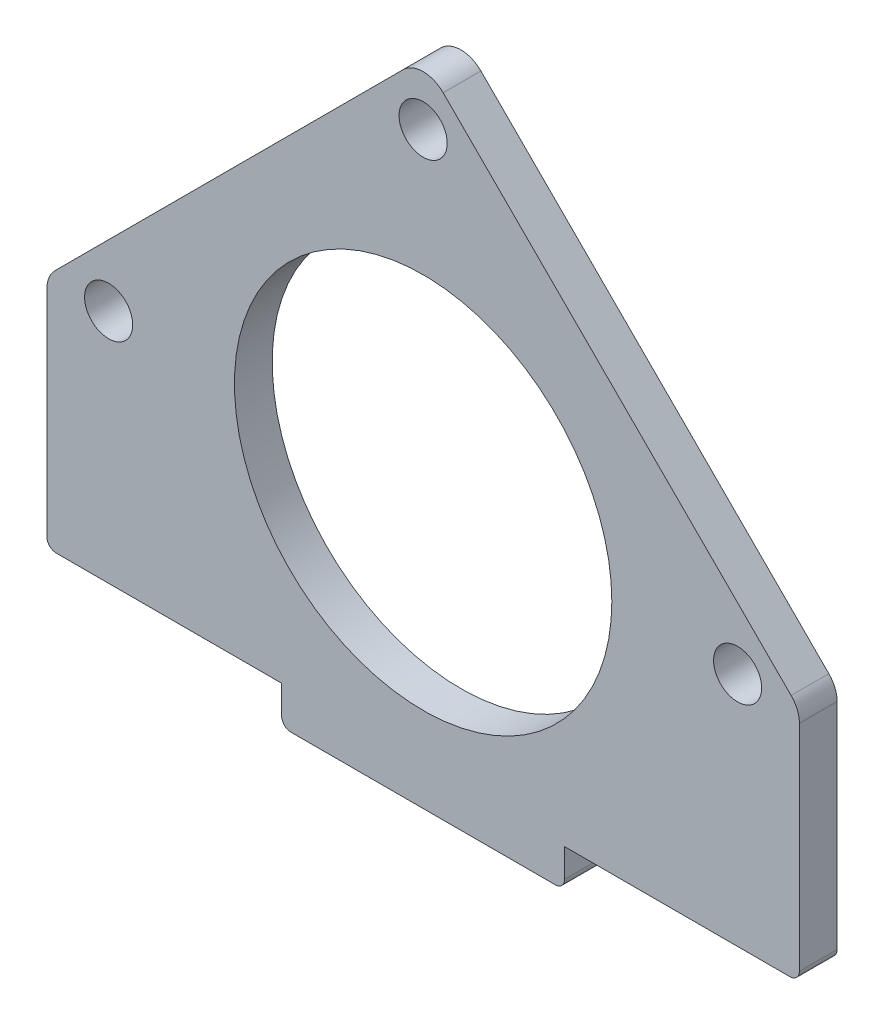
ISO-10303-21;
HEADER;
FILE_DESCRIPTION(('STEP AP214'),'2;1');
FILE_NAME('part.step','',(''),(''),'','','');
FILE_SCHEMA(('AUTOMOTIVE_DESIGN { 1 0 10303 214 1 1 1 1 }'));
ENDSEC;
DATA;
#1=APPLICATION_CONTEXT('core data for automotive mechanical design processes');
#2=APPLICATION_PROTOCOL_DEFINITION('international standard','automotive_design',2000,#1);
#3=PRODUCT_CONTEXT('',#1,'mechanical');
#4=PRODUCT('Part','Part','',(#3));
#5=PRODUCT_RELATED_PRODUCT_CATEGORY('part','',(#4));
#6=PRODUCT_DEFINITION_FORMATION('','',#4);
#7=PRODUCT_DEFINITION_CONTEXT('part definition',#1,'design');
#8=PRODUCT_DEFINITION('design','',#6,#7);
#9=PRODUCT_DEFINITION_SHAPE('','',#8);
#10=(LENGTH_UNIT() NAMED_UNIT(*) SI_UNIT(.MILLI.,.METRE.));
#11=(NAMED_UNIT(*) PLANE_ANGLE_UNIT() SI_UNIT($,.RADIAN.));
#12=(NAMED_UNIT(*) SI_UNIT($,.STERADIAN.) SOLID_ANGLE_UNIT());
#13=UNCERTAINTY_MEASURE_WITH_UNIT(LENGTH_MEASURE(1.E-05),#10,'distance_accuracy_value','');
#14=(GEOMETRIC_REPRESENTATION_CONTEXT(3) GLOBAL_UNCERTAINTY_ASSIGNED_CONTEXT((#13)) GLOBAL_UNIT_ASSIGNED_CONTEXT((#10,
#11,#12)) REPRESENTATION_CONTEXT('',''));
#15=CARTESIAN_POINT('',(0.,0.,0.));
#16=DIRECTION('',(0.,0.,1.));
#17=DIRECTION('',(1.,0.,0.));
#18=AXIS2_PLACEMENT_3D('',#15,#16,#17);
#19=CARTESIAN_POINT('',(0.,0.,4.));
#20=DIRECTION('',(0.,0.,1.));
#21=DIRECTION('',(1.,0.,0.));
#22=AXIS2_PLACEMENT_3D('',#19,#20,#21);
#23=PLANE('',#22);
#24=CARTESIAN_POINT('',(33.3330136651338,0.,4.));
#25=DIRECTION('',(0.,0.,1.));
#26=DIRECTION('',(1.,0.,0.));
#27=AXIS2_PLACEMENT_3D('',#24,#25,#26);
#28=CIRCLE('',#27,2.55);
#29=CARTESIAN_POINT('',(35.8830136651338,0.,4.));
#30=VERTEX_POINT('',#29);
#31=EDGE_CURVE('E340',#30,#30,#28,.T.);
#32=ORIENTED_EDGE('',*,*,#31,.F.);
#33=EDGE_LOOP('',(#32));
#34=FACE_BOUND('',#33,.T.);
#35=CARTESIAN_POINT('',(-33.3330136651338,0.,4.));
#36=DIRECTION('',(0.,0.,1.));
#37=DIRECTION('',(1.,0.,0.));
#38=AXIS2_PLACEMENT_3D('',#35,#36,#37);
#39=CIRCLE('',#38,2.55);
#40=CARTESIAN_POINT('',(-30.7830136651338,0.,4.));
#41=VERTEX_POINT('',#40);
#42=EDGE_CURVE('E195',#41,#41,#39,.T.);
#43=ORIENTED_EDGE('',*,*,#42,.F.);
#44=EDGE_LOOP('',(#43));
#45=FACE_BOUND('',#44,.T.);
#46=DIRECTION('',(1.,0.,0.));
#47=VECTOR('',#46,1.);
#48=CARTESIAN_POINT('',(15.,-29.,4.));
#49=LINE('',#48,#47);
#50=CARTESIAN_POINT('',(-14.,-29.,4.));
#51=VERTEX_POINT('',#50);
#52=CARTESIAN_POINT('',(14.,-29.,4.));
#53=VERTEX_POINT('',#52);
#54=EDGE_CURVE('E175',#51,#53,#49,.T.);
#55=ORIENTED_EDGE('',*,*,#54,.T.);
#56=CARTESIAN_POINT('',(14.,-28.,4.));
#57=DIRECTION('',(0.,0.,1.));
#58=DIRECTION('',(1.,0.,0.));
#59=AXIS2_PLACEMENT_3D('',#56,#57,#58);
#60=CIRCLE('',#59,1.);
#61=CARTESIAN_POINT('',(15.,-28.,4.));
#62=VERTEX_POINT('',#61);
#63=EDGE_CURVE('E265',#53,#62,#60,.T.);
#64=ORIENTED_EDGE('',*,*,#63,.T.);
#65=DIRECTION('',(0.,1.,0.));
#66=VECTOR('',#65,1.);
#67=CARTESIAN_POINT('',(15.,-29.,4.));
#68=LINE('',#67,#66);
#69=CARTESIAN_POINT('',(15.,-25.,4.));
#70=VERTEX_POINT('',#69);
#71=EDGE_CURVE('E177',#62,#70,#68,.T.);
#72=ORIENTED_EDGE('',*,*,#71,.T.);
#73=DIRECTION('',(1.,0.,0.));
#74=VECTOR('',#73,1.);
#75=CARTESIAN_POINT('',(15.,-25.,4.));
#76=LINE('',#75,#74);
#77=CARTESIAN_POINT('',(38.8808224589212,-25.,4.));
#78=VERTEX_POINT('',#77);
#79=EDGE_CURVE('E182',#70,#78,#76,.T.);
#80=ORIENTED_EDGE('',*,*,#79,.T.);
#81=CARTESIAN_POINT('',(38.8808224589212,-24.,4.));
#82=DIRECTION('',(0.,0.,1.));
#83=DIRECTION('',(1.,0.,0.));
#84=AXIS2_PLACEMENT_3D('',#81,#82,#83);
#85=CIRCLE('',#84,1.);
#86=CARTESIAN_POINT('',(39.8808224589212,-24.,4.));
#87=VERTEX_POINT('',#86);
#88=EDGE_CURVE('E263',#78,#87,#85,.T.);
#89=ORIENTED_EDGE('',*,*,#88,.T.);
#90=DIRECTION('',(0.,1.,0.));
#91=VECTOR('',#90,1.);
#92=CARTESIAN_POINT('',(39.8808224589212,-25.,4.));
#93=LINE('',#92,#91);
#94=CARTESIAN_POINT('',(39.8808224589212,-1.24264068711931,4.));
#95=VERTEX_POINT('',#94);
#96=EDGE_CURVE('E184',#87,#95,#93,.T.);
#97=ORIENTED_EDGE('',*,*,#96,.T.);
#98=CARTESIAN_POINT('',(36.8808224589212,-1.2426406871193,4.));
#99=DIRECTION('',(0.,0.,1.));
#100=DIRECTION('',(1.,0.,0.));
#101=AXIS2_PLACEMENT_3D('',#98,#99,#100);
#102=CIRCLE('',#101,3.);
#103=CARTESIAN_POINT('',(39.0021428024809,0.878679656440326,4.));
#104=VERTEX_POINT('',#103);
#105=EDGE_CURVE('E234',#95,#104,#102,.T.);
#106=ORIENTED_EDGE('',*,*,#105,.T.);
#107=DIRECTION('',(-0.707106781186546,0.707106781186549,0.));
#108=VECTOR('',#107,1.);
#109=CARTESIAN_POINT('',(0.,39.8808224589213,4.));
#110=LINE('',#109,#108);
#111=CARTESIAN_POINT('',(2.12132034355964,37.7595021153617,4.));
#112=VERTEX_POINT('',#111);
#113=EDGE_CURVE('E186',#104,#112,#110,.T.);
#114=ORIENTED_EDGE('',*,*,#113,.T.);
#115=CARTESIAN_POINT('',(0.,35.638181771802,4.));
#116=DIRECTION('',(0.,0.,1.));
#117=DIRECTION('',(1.,0.,0.));
#118=AXIS2_PLACEMENT_3D('',#115,#116,#117);
#119=CIRCLE('',#118,3.);
#120=CARTESIAN_POINT('',(-2.12132034355965,37.7595021153617,4.));
#121=VERTEX_POINT('',#120);
#122=EDGE_CURVE('E230',#112,#121,#119,.T.);
#123=ORIENTED_EDGE('',*,*,#122,.T.);
#124=DIRECTION('',(-0.707106781186546,-0.707106781186549,0.));
#125=VECTOR('',#124,1.);
#126=CARTESIAN_POINT('',(-39.8808224589212,0.,4.));
#127=LINE('',#126,#125);
#128=CARTESIAN_POINT('',(-39.0021428024809,0.878679656440357,4.));
#129=VERTEX_POINT('',#128);
#130=EDGE_CURVE('E189',#121,#129,#127,.T.);
#131=ORIENTED_EDGE('',*,*,#130,.T.);
#132=CARTESIAN_POINT('',(-36.8808224589212,-1.24264068711928,4.));
#133=DIRECTION('',(0.,0.,1.));
#134=DIRECTION('',(1.,0.,0.));
#135=AXIS2_PLACEMENT_3D('',#132,#133,#134);
#136=CIRCLE('',#135,3.);
#137=CARTESIAN_POINT('',(-39.8808224589212,-1.24264068711928,4.));
#138=VERTEX_POINT('',#137);
#139=EDGE_CURVE('E232',#129,#138,#136,.T.);
#140=ORIENTED_EDGE('',*,*,#139,.T.);
#141=DIRECTION('',(0.,-1.,0.));
#142=VECTOR('',#141,1.);
#143=CARTESIAN_POINT('',(-39.8808224589212,0.,4.));
#144=LINE('',#143,#142);
#145=CARTESIAN_POINT('',(-39.8808224589212,-24.,4.));
#146=VERTEX_POINT('',#145);
#147=EDGE_CURVE('E163',#138,#146,#144,.T.);
#148=ORIENTED_EDGE('',*,*,#147,.T.);
#149=CARTESIAN_POINT('',(-38.8808224589212,-24.,4.));
#150=DIRECTION('',(0.,0.,1.));
#151=DIRECTION('',(1.,0.,0.));
#152=AXIS2_PLACEMENT_3D('',#149,#150,#151);
#153=CIRCLE('',#152,1.);
#154=CARTESIAN_POINT('',(-38.8808224589212,-25.,4.));
#155=VERTEX_POINT('',#154);
#156=EDGE_CURVE('E159',#146,#155,#153,.T.);
#157=ORIENTED_EDGE('',*,*,#156,.T.);
#158=DIRECTION('',(1.,0.,0.));
#159=VECTOR('',#158,1.);
#160=CARTESIAN_POINT('',(-39.8808224589212,-25.,4.));
#161=LINE('',#160,#159);
#162=CARTESIAN_POINT('',(-15.,-25.,4.));
#163=VERTEX_POINT('',#162);
#164=EDGE_CURVE('E151',#155,#163,#161,.T.);
#165=ORIENTED_EDGE('',*,*,#164,.T.);
#166=DIRECTION('',(0.,-1.,0.));
#167=VECTOR('',#166,1.);
#168=CARTESIAN_POINT('',(-15.,-25.,4.));
#169=LINE('',#168,#167);
#170=CARTESIAN_POINT('',(-15.,-28.,4.));
#171=VERTEX_POINT('',#170);
#172=EDGE_CURVE('E155',#163,#171,#169,.T.);
#173=ORIENTED_EDGE('',*,*,#172,.T.);
#174=CARTESIAN_POINT('',(-14.,-28.,4.));
#175=DIRECTION('',(0.,0.,1.));
#176=DIRECTION('',(1.,0.,0.));
#177=AXIS2_PLACEMENT_3D('',#174,#175,#176);
#178=CIRCLE('',#177,1.);
#179=EDGE_CURVE('E261',#171,#51,#178,.T.);
#180=ORIENTED_EDGE('',*,*,#179,.T.);
#181=EDGE_LOOP('',(#55,#64,#72,#80,#89,#97,#106,#114,#123,#131,#140,#148,#157,#165,#173,#180));
#182=FACE_BOUND('',#181,.T.);
#183=CARTESIAN_POINT('',(0.,33.3330136651338,4.));
#184=DIRECTION('',(0.,0.,1.));
#185=DIRECTION('',(1.,0.,0.));
#186=AXIS2_PLACEMENT_3D('',#183,#184,#185);
#187=CIRCLE('',#186,2.55);
#188=CARTESIAN_POINT('',(2.55,33.3330136651338,4.));
#189=VERTEX_POINT('',#188);
#190=EDGE_CURVE('E334',#189,#189,#187,.T.);
#191=ORIENTED_EDGE('',*,*,#190,.F.);
#192=EDGE_LOOP('',(#191));
#193=FACE_BOUND('',#192,.T.);
#194=CARTESIAN_POINT('',(0.,0.,4.));
#195=DIRECTION('',(0.,0.,1.));
#196=DIRECTION('',(1.,0.,0.));
#197=AXIS2_PLACEMENT_3D('',#194,#195,#196);
#198=CIRCLE('',#197,20.);
#199=CARTESIAN_POINT('',(20.,0.,4.));
#200=VERTEX_POINT('',#199);
#201=EDGE_CURVE('E346',#200,#200,#198,.T.);
#202=ORIENTED_EDGE('',*,*,#201,.F.);
#203=EDGE_LOOP('',(#202));
#204=FACE_BOUND('',#203,.T.);
#205=ADVANCED_FACE('F36',(#34,#45,#182,#193,#204),#23,.T.);
#206=CARTESIAN_POINT('',(0.,0.,0.));
#207=DIRECTION('',(0.,0.,1.));
#208=DIRECTION('',(1.,0.,0.));
#209=AXIS2_PLACEMENT_3D('',#206,#207,#208);
#210=PLANE('',#209);
#211=DIRECTION('',(0.,1.,0.));
#212=VECTOR('',#211,1.);
#213=CARTESIAN_POINT('',(15.,-29.,0.));
#214=LINE('',#213,#212);
#215=CARTESIAN_POINT('',(15.,-28.,0.));
#216=VERTEX_POINT('',#215);
#217=CARTESIAN_POINT('',(15.,-25.,0.));
#218=VERTEX_POINT('',#217);
#219=EDGE_CURVE('E202',#216,#218,#214,.T.);
#220=ORIENTED_EDGE('',*,*,#219,.F.);
#221=CARTESIAN_POINT('',(14.,-28.,0.));
#222=DIRECTION('',(0.,0.,1.));
#223=DIRECTION('',(1.,0.,0.));
#224=AXIS2_PLACEMENT_3D('',#221,#222,#223);
#225=CIRCLE('',#224,1.);
#226=CARTESIAN_POINT('',(14.,-29.,0.));
#227=VERTEX_POINT('',#226);
#228=EDGE_CURVE('E253',#216,#227,#225,.F.);
#229=ORIENTED_EDGE('',*,*,#228,.T.);
#230=DIRECTION('',(1.,0.,0.));
#231=VECTOR('',#230,1.);
#232=CARTESIAN_POINT('',(15.,-29.,0.));
#233=LINE('',#232,#231);
#234=CARTESIAN_POINT('',(-14.,-29.,0.));
#235=VERTEX_POINT('',#234);
#236=EDGE_CURVE('E199',#235,#227,#233,.T.);
#237=ORIENTED_EDGE('',*,*,#236,.F.);
#238=CARTESIAN_POINT('',(-14.,-28.,0.));
#239=DIRECTION('',(0.,0.,1.));
#240=DIRECTION('',(1.,0.,0.));
#241=AXIS2_PLACEMENT_3D('',#238,#239,#240);
#242=CIRCLE('',#241,1.);
#243=CARTESIAN_POINT('',(-15.,-28.,0.));
#244=VERTEX_POINT('',#243);
#245=EDGE_CURVE('E249',#235,#244,#242,.F.);
#246=ORIENTED_EDGE('',*,*,#245,.T.);
#247=DIRECTION('',(0.,-1.,0.));
#248=VECTOR('',#247,1.);
#249=CARTESIAN_POINT('',(-15.,-25.,0.));
#250=LINE('',#249,#248);
#251=CARTESIAN_POINT('',(-15.,-25.,0.));
#252=VERTEX_POINT('',#251);
#253=EDGE_CURVE('E197',#252,#244,#250,.T.);
#254=ORIENTED_EDGE('',*,*,#253,.F.);
#255=DIRECTION('',(1.,0.,0.));
#256=VECTOR('',#255,1.);
#257=CARTESIAN_POINT('',(-39.8808224589212,-25.,0.));
#258=LINE('',#257,#256);
#259=CARTESIAN_POINT('',(-38.8808224589212,-25.,0.));
#260=VERTEX_POINT('',#259);
#261=EDGE_CURVE('E169',#260,#252,#258,.T.);
#262=ORIENTED_EDGE('',*,*,#261,.F.);
#263=CARTESIAN_POINT('',(-38.8808224589212,-24.,0.));
#264=DIRECTION('',(0.,0.,1.));
#265=DIRECTION('',(1.,0.,0.));
#266=AXIS2_PLACEMENT_3D('',#263,#264,#265);
#267=CIRCLE('',#266,1.);
#268=CARTESIAN_POINT('',(-39.8808224589212,-24.,0.));
#269=VERTEX_POINT('',#268);
#270=EDGE_CURVE('E247',#260,#269,#267,.F.);
#271=ORIENTED_EDGE('',*,*,#270,.T.);
#272=DIRECTION('',(0.,-1.,0.));
#273=VECTOR('',#272,1.);
#274=CARTESIAN_POINT('',(-39.8808224589212,0.,0.));
#275=LINE('',#274,#273);
#276=CARTESIAN_POINT('',(-39.8808224589212,-1.24264068711928,0.));
#277=VERTEX_POINT('',#276);
#278=EDGE_CURVE('E192',#277,#269,#275,.T.);
#279=ORIENTED_EDGE('',*,*,#278,.F.);
#280=CARTESIAN_POINT('',(-36.8808224589212,-1.24264068711928,0.));
#281=DIRECTION('',(0.,0.,1.));
#282=DIRECTION('',(1.,0.,0.));
#283=AXIS2_PLACEMENT_3D('',#280,#281,#282);
#284=CIRCLE('',#283,3.);
#285=CARTESIAN_POINT('',(-39.0021428024809,0.878679656440357,0.));
#286=VERTEX_POINT('',#285);
#287=EDGE_CURVE('E222',#277,#286,#284,.F.);
#288=ORIENTED_EDGE('',*,*,#287,.T.);
#289=DIRECTION('',(-0.707106781186546,-0.707106781186549,0.));
#290=VECTOR('',#289,1.);
#291=CARTESIAN_POINT('',(-39.8808224589212,0.,0.));
#292=LINE('',#291,#290);
#293=CARTESIAN_POINT('',(-2.12132034355965,37.7595021153617,0.));
#294=VERTEX_POINT('',#293);
#295=EDGE_CURVE('E211',#294,#286,#292,.T.);
#296=ORIENTED_EDGE('',*,*,#295,.F.);
#297=CARTESIAN_POINT('',(0.,35.638181771802,0.));
#298=DIRECTION('',(0.,0.,1.));
#299=DIRECTION('',(1.,0.,0.));
#300=AXIS2_PLACEMENT_3D('',#297,#298,#299);
#301=CIRCLE('',#300,3.);
#302=CARTESIAN_POINT('',(2.12132034355964,37.7595021153617,0.));
#303=VERTEX_POINT('',#302);
#304=EDGE_CURVE('E220',#294,#303,#301,.F.);
#305=ORIENTED_EDGE('',*,*,#304,.T.);
#306=DIRECTION('',(-0.707106781186546,0.707106781186549,0.));
#307=VECTOR('',#306,1.);
#308=CARTESIAN_POINT('',(0.,39.8808224589213,0.));
#309=LINE('',#308,#307);
#310=CARTESIAN_POINT('',(39.0021428024809,0.878679656440326,0.));
#311=VERTEX_POINT('',#310);
#312=EDGE_CURVE('E208',#311,#303,#309,.T.);
#313=ORIENTED_EDGE('',*,*,#312,.F.);
#314=CARTESIAN_POINT('',(36.8808224589212,-1.2426406871193,0.));
#315=DIRECTION('',(0.,0.,1.));
#316=DIRECTION('',(1.,0.,0.));
#317=AXIS2_PLACEMENT_3D('',#314,#315,#316);
#318=CIRCLE('',#317,3.);
#319=CARTESIAN_POINT('',(39.8808224589212,-1.24264068711931,0.));
#320=VERTEX_POINT('',#319);
#321=EDGE_CURVE('E224',#311,#320,#318,.F.);
#322=ORIENTED_EDGE('',*,*,#321,.T.);
#323=DIRECTION('',(0.,1.,0.));
#324=VECTOR('',#323,1.);
#325=CARTESIAN_POINT('',(39.8808224589212,-25.,0.));
#326=LINE('',#325,#324);
#327=CARTESIAN_POINT('',(39.8808224589212,-24.,0.));
#328=VERTEX_POINT('',#327);
#329=EDGE_CURVE('E206',#328,#320,#326,.T.);
#330=ORIENTED_EDGE('',*,*,#329,.F.);
#331=CARTESIAN_POINT('',(38.8808224589212,-24.,0.));
#332=DIRECTION('',(0.,0.,1.));
#333=DIRECTION('',(1.,0.,0.));
#334=AXIS2_PLACEMENT_3D('',#331,#332,#333);
#335=CIRCLE('',#334,1.);
#336=CARTESIAN_POINT('',(38.8808224589212,-25.,0.));
#337=VERTEX_POINT('',#336);
#338=EDGE_CURVE('E251',#328,#337,#335,.F.);
#339=ORIENTED_EDGE('',*,*,#338,.T.);
#340=DIRECTION('',(1.,0.,0.));
#341=VECTOR('',#340,1.);
#342=CARTESIAN_POINT('',(15.,-25.,0.));
#343=LINE('',#342,#341);
#344=EDGE_CURVE('E204',#218,#337,#343,.T.);
#345=ORIENTED_EDGE('',*,*,#344,.F.);
#346=EDGE_LOOP('',(#220,#229,#237,#246,#254,#262,#271,#279,#288,#296,#305,#313,#322,#330,#339,#345));
#347=FACE_BOUND('',#346,.T.);
#348=CARTESIAN_POINT('',(-33.3330136651338,0.,0.));
#349=DIRECTION('',(0.,0.,1.));
#350=DIRECTION('',(1.,0.,0.));
#351=AXIS2_PLACEMENT_3D('',#348,#349,#350);
#352=CIRCLE('',#351,2.55);
#353=CARTESIAN_POINT('',(-30.7830136651338,0.,0.));
#354=VERTEX_POINT('',#353);
#355=EDGE_CURVE('E331',#354,#354,#352,.T.);
#356=ORIENTED_EDGE('',*,*,#355,.T.);
#357=EDGE_LOOP('',(#356));
#358=FACE_BOUND('',#357,.T.);
#359=CARTESIAN_POINT('',(0.,33.3330136651338,0.));
#360=DIRECTION('',(0.,0.,1.));
#361=DIRECTION('',(1.,0.,0.));
#362=AXIS2_PLACEMENT_3D('',#359,#360,#361);
#363=CIRCLE('',#362,2.55);
#364=CARTESIAN_POINT('',(2.55,33.3330136651338,0.));
#365=VERTEX_POINT('',#364);
#366=EDGE_CURVE('E337',#365,#365,#363,.T.);
#367=ORIENTED_EDGE('',*,*,#366,.T.);
#368=EDGE_LOOP('',(#367));
#369=FACE_BOUND('',#368,.T.);
#370=CARTESIAN_POINT('',(33.3330136651338,0.,0.));
#371=DIRECTION('',(0.,0.,1.));
#372=DIRECTION('',(1.,0.,0.));
#373=AXIS2_PLACEMENT_3D('',#370,#371,#372);
#374=CIRCLE('',#373,2.55);
#375=CARTESIAN_POINT('',(35.8830136651338,0.,0.));
#376=VERTEX_POINT('',#375);
#377=EDGE_CURVE('E343',#376,#376,#374,.T.);
#378=ORIENTED_EDGE('',*,*,#377,.T.);
#379=EDGE_LOOP('',(#378));
#380=FACE_BOUND('',#379,.T.);
#381=CARTESIAN_POINT('',(0.,0.,0.));
#382=DIRECTION('',(0.,0.,1.));
#383=DIRECTION('',(1.,0.,0.));
#384=AXIS2_PLACEMENT_3D('',#381,#382,#383);
#385=CIRCLE('',#384,20.);
#386=CARTESIAN_POINT('',(20.,0.,0.));
#387=VERTEX_POINT('',#386);
#388=EDGE_CURVE('E349',#387,#387,#385,.T.);
#389=ORIENTED_EDGE('',*,*,#388,.T.);
#390=EDGE_LOOP('',(#389));
#391=FACE_BOUND('',#390,.T.);
#392=ADVANCED_FACE('F274',(#347,#358,#369,#380,#391),#210,.F.);
#393=CARTESIAN_POINT('',(-39.8808224589212,0.,4.));
#394=DIRECTION('',(1.,0.,0.));
#395=DIRECTION('',(0.,0.,-1.));
#396=AXIS2_PLACEMENT_3D('',#393,#394,#395);
#397=PLANE('',#396);
#398=ORIENTED_EDGE('',*,*,#278,.T.);
#399=DIRECTION('',(0.,0.,-1.));
#400=VECTOR('',#399,1.);
#401=CARTESIAN_POINT('',(-39.8808224589212,-24.,4.));
#402=LINE('',#401,#400);
#403=EDGE_CURVE('E11',#269,#146,#402,.F.);
#404=ORIENTED_EDGE('',*,*,#403,.T.);
#405=ORIENTED_EDGE('',*,*,#147,.F.);
#406=DIRECTION('',(0.,0.,-1.));
#407=VECTOR('',#406,1.);
#408=CARTESIAN_POINT('',(-39.8808224589212,-1.24264068711928,4.));
#409=LINE('',#408,#407);
#410=EDGE_CURVE('E236',#138,#277,#409,.T.);
#411=ORIENTED_EDGE('',*,*,#410,.T.);
#412=EDGE_LOOP('',(#398,#404,#405,#411));
#413=FACE_BOUND('',#412,.T.);
#414=ADVANCED_FACE('F328',(#413),#397,.F.);
#415=CARTESIAN_POINT('',(-39.8808224589212,-25.,4.));
#416=DIRECTION('',(0.,1.,0.));
#417=DIRECTION('',(-1.,0.,0.));
#418=AXIS2_PLACEMENT_3D('',#415,#416,#417);
#419=PLANE('',#418);
#420=ORIENTED_EDGE('',*,*,#164,.F.);
#421=DIRECTION('',(0.,0.,-1.));
#422=VECTOR('',#421,1.);
#423=CARTESIAN_POINT('',(-38.8808224589212,-25.,4.));
#424=LINE('',#423,#422);
#425=EDGE_CURVE('E44',#155,#260,#424,.T.);
#426=ORIENTED_EDGE('',*,*,#425,.T.);
#427=ORIENTED_EDGE('',*,*,#261,.T.);
#428=DIRECTION('',(0.,0.,-1.));
#429=VECTOR('',#428,1.);
#430=CARTESIAN_POINT('',(-15.,-25.,4.));
#431=LINE('',#430,#429);
#432=EDGE_CURVE('E166',#163,#252,#431,.T.);
#433=ORIENTED_EDGE('',*,*,#432,.F.);
#434=EDGE_LOOP('',(#420,#426,#427,#433));
#435=FACE_BOUND('',#434,.T.);
#436=ADVANCED_FACE('F167',(#435),#419,.F.);
#437=CARTESIAN_POINT('',(-15.,-25.,4.));
#438=DIRECTION('',(1.,0.,0.));
#439=DIRECTION('',(0.,1.,0.));
#440=AXIS2_PLACEMENT_3D('',#437,#438,#439);
#441=PLANE('',#440);
#442=ORIENTED_EDGE('',*,*,#253,.T.);
#443=DIRECTION('',(0.,0.,-1.));
#444=VECTOR('',#443,1.);
#445=CARTESIAN_POINT('',(-15.,-28.,4.));
#446=LINE('',#445,#444);
#447=EDGE_CURVE('E59',#244,#171,#446,.F.);
#448=ORIENTED_EDGE('',*,*,#447,.T.);
#449=ORIENTED_EDGE('',*,*,#172,.F.);
#450=ORIENTED_EDGE('',*,*,#432,.T.);
#451=EDGE_LOOP('',(#442,#448,#449,#450));
#452=FACE_BOUND('',#451,.T.);
#453=ADVANCED_FACE('F174',(#452),#441,.F.);
#454=CARTESIAN_POINT('',(15.,-29.,4.));
#455=DIRECTION('',(0.,1.,0.));
#456=DIRECTION('',(-1.,0.,0.));
#457=AXIS2_PLACEMENT_3D('',#454,#455,#456);
#458=PLANE('',#457);
#459=ORIENTED_EDGE('',*,*,#236,.T.);
#460=DIRECTION('',(0.,0.,-1.));
#461=VECTOR('',#460,1.);
#462=CARTESIAN_POINT('',(14.,-29.,4.));
#463=LINE('',#462,#461);
#464=EDGE_CURVE('E258',#227,#53,#463,.F.);
#465=ORIENTED_EDGE('',*,*,#464,.T.);
#466=ORIENTED_EDGE('',*,*,#54,.F.);
#467=DIRECTION('',(0.,0.,-1.));
#468=VECTOR('',#467,1.);
#469=CARTESIAN_POINT('',(-14.,-29.,4.));
#470=LINE('',#469,#468);
#471=EDGE_CURVE('E255',#51,#235,#470,.T.);
#472=ORIENTED_EDGE('',*,*,#471,.T.);
#473=EDGE_LOOP('',(#459,#465,#466,#472));
#474=FACE_BOUND('',#473,.T.);
#475=ADVANCED_FACE('F284',(#474),#458,.F.);
#476=CARTESIAN_POINT('',(15.,-29.,4.));
#477=DIRECTION('',(-1.,0.,0.));
#478=DIRECTION('',(0.,-1.,0.));
#479=AXIS2_PLACEMENT_3D('',#476,#477,#478);
#480=PLANE('',#479);
#481=ORIENTED_EDGE('',*,*,#71,.F.);
#482=DIRECTION('',(0.,0.,-1.));
#483=VECTOR('',#482,1.);
#484=CARTESIAN_POINT('',(15.,-28.,4.));
#485=LINE('',#484,#483);
#486=EDGE_CURVE('E244',#62,#216,#485,.T.);
#487=ORIENTED_EDGE('',*,*,#486,.T.);
#488=ORIENTED_EDGE('',*,*,#219,.T.);
#489=DIRECTION('',(0.,0.,-1.));
#490=VECTOR('',#489,1.);
#491=CARTESIAN_POINT('',(15.,-25.,4.));
#492=LINE('',#491,#490);
#493=EDGE_CURVE('E172',#70,#218,#492,.T.);
#494=ORIENTED_EDGE('',*,*,#493,.F.);
#495=EDGE_LOOP('',(#481,#487,#488,#494));
#496=FACE_BOUND('',#495,.T.);
#497=ADVANCED_FACE('F292',(#496),#480,.F.);
#498=CARTESIAN_POINT('',(15.,-25.,4.));
#499=DIRECTION('',(0.,1.,0.));
#500=DIRECTION('',(-1.,0.,0.));
#501=AXIS2_PLACEMENT_3D('',#498,#499,#500);
#502=PLANE('',#501);
#503=ORIENTED_EDGE('',*,*,#344,.T.);
#504=DIRECTION('',(0.,0.,-1.));
#505=VECTOR('',#504,1.);
#506=CARTESIAN_POINT('',(38.8808224589212,-25.,4.));
#507=LINE('',#506,#505);
#508=EDGE_CURVE('E51',#337,#78,#507,.F.);
#509=ORIENTED_EDGE('',*,*,#508,.T.);
#510=ORIENTED_EDGE('',*,*,#79,.F.);
#511=ORIENTED_EDGE('',*,*,#493,.T.);
#512=EDGE_LOOP('',(#503,#509,#510,#511));
#513=FACE_BOUND('',#512,.T.);
#514=ADVANCED_FACE('F294',(#513),#502,.F.);
#515=CARTESIAN_POINT('',(39.8808224589212,-25.,4.));
#516=DIRECTION('',(-1.,0.,0.));
#517=DIRECTION('',(0.,-1.,0.));
#518=AXIS2_PLACEMENT_3D('',#515,#516,#517);
#519=PLANE('',#518);
#520=ORIENTED_EDGE('',*,*,#96,.F.);
#521=DIRECTION('',(0.,0.,-1.));
#522=VECTOR('',#521,1.);
#523=CARTESIAN_POINT('',(39.8808224589212,-24.,4.));
#524=LINE('',#523,#522);
#525=EDGE_CURVE('E267',#87,#328,#524,.T.);
#526=ORIENTED_EDGE('',*,*,#525,.T.);
#527=ORIENTED_EDGE('',*,*,#329,.T.);
#528=DIRECTION('',(0.,0.,-1.));
#529=VECTOR('',#528,1.);
#530=CARTESIAN_POINT('',(39.8808224589212,-1.2426406871193,4.));
#531=LINE('',#530,#529);
#532=EDGE_CURVE('E227',#320,#95,#531,.F.);
#533=ORIENTED_EDGE('',*,*,#532,.T.);
#534=EDGE_LOOP('',(#520,#526,#527,#533));
#535=FACE_BOUND('',#534,.T.);
#536=ADVANCED_FACE('F302',(#535),#519,.F.);
#537=CARTESIAN_POINT('',(0.,39.8808224589213,4.));
#538=DIRECTION('',(-0.707106781186549,-0.707106781186546,0.));
#539=DIRECTION('',(0.707106781186546,-0.707106781186549,0.));
#540=AXIS2_PLACEMENT_3D('',#537,#538,#539);
#541=PLANE('',#540);
#542=ORIENTED_EDGE('',*,*,#113,.F.);
#543=DIRECTION('',(0.,0.,-1.));
#544=VECTOR('',#543,1.);
#545=CARTESIAN_POINT('',(39.0021428024809,0.87867965644034,4.));
#546=LINE('',#545,#544);
#547=EDGE_CURVE('E217',#104,#311,#546,.T.);
#548=ORIENTED_EDGE('',*,*,#547,.T.);
#549=ORIENTED_EDGE('',*,*,#312,.T.);
#550=DIRECTION('',(0.,0.,-1.));
#551=VECTOR('',#550,1.);
#552=CARTESIAN_POINT('',(2.12132034355964,37.7595021153617,4.));
#553=LINE('',#552,#551);
#554=EDGE_CURVE('E171',#303,#112,#553,.F.);
#555=ORIENTED_EDGE('',*,*,#554,.T.);
#556=EDGE_LOOP('',(#542,#548,#549,#555));
#557=FACE_BOUND('',#556,.T.);
#558=ADVANCED_FACE('F312',(#557),#541,.F.);
#559=CARTESIAN_POINT('',(-39.8808224589212,0.,4.));
#560=DIRECTION('',(0.707106781186549,-0.707106781186546,0.));
#561=DIRECTION('',(0.707106781186546,0.707106781186549,0.));
#562=AXIS2_PLACEMENT_3D('',#559,#560,#561);
#563=PLANE('',#562);
#564=ORIENTED_EDGE('',*,*,#295,.T.);
#565=DIRECTION('',(0.,0.,-1.));
#566=VECTOR('',#565,1.);
#567=CARTESIAN_POINT('',(-39.0021428024809,0.878679656440357,4.));
#568=LINE('',#567,#566);
#569=EDGE_CURVE('E242',#286,#129,#568,.F.);
#570=ORIENTED_EDGE('',*,*,#569,.T.);
#571=ORIENTED_EDGE('',*,*,#130,.F.);
#572=DIRECTION('',(0.,0.,-1.));
#573=VECTOR('',#572,1.);
#574=CARTESIAN_POINT('',(-2.12132034355965,37.7595021153617,4.));
#575=LINE('',#574,#573);
#576=EDGE_CURVE('E239',#121,#294,#575,.T.);
#577=ORIENTED_EDGE('',*,*,#576,.T.);
#578=EDGE_LOOP('',(#564,#570,#571,#577));
#579=FACE_BOUND('',#578,.T.);
#580=ADVANCED_FACE('F320',(#579),#563,.F.);
#581=CARTESIAN_POINT('',(-33.3330136651338,0.,4.));
#582=DIRECTION('',(0.,0.,-1.));
#583=DIRECTION('',(-1.,0.,0.));
#584=AXIS2_PLACEMENT_3D('',#581,#582,#583);
#585=CYLINDRICAL_SURFACE('',#584,2.55);
#586=ORIENTED_EDGE('',*,*,#42,.T.);
#587=EDGE_LOOP('',(#586));
#588=FACE_BOUND('',#587,.T.);
#589=ORIENTED_EDGE('',*,*,#355,.F.);
#590=EDGE_LOOP('',(#589));
#591=FACE_BOUND('',#590,.T.);
#592=ADVANCED_FACE('F368',(#588,#591),#585,.F.);
#593=CARTESIAN_POINT('',(0.,33.3330136651338,4.));
#594=DIRECTION('',(0.,0.,-1.));
#595=DIRECTION('',(-1.,0.,0.));
#596=AXIS2_PLACEMENT_3D('',#593,#594,#595);
#597=CYLINDRICAL_SURFACE('',#596,2.55);
#598=ORIENTED_EDGE('',*,*,#190,.T.);
#599=EDGE_LOOP('',(#598));
#600=FACE_BOUND('',#599,.T.);
#601=ORIENTED_EDGE('',*,*,#366,.F.);
#602=EDGE_LOOP('',(#601));
#603=FACE_BOUND('',#602,.T.);
#604=ADVANCED_FACE('F522',(#600,#603),#597,.F.);
#605=CARTESIAN_POINT('',(33.3330136651338,0.,4.));
#606=DIRECTION('',(0.,0.,-1.));
#607=DIRECTION('',(-1.,0.,0.));
#608=AXIS2_PLACEMENT_3D('',#605,#606,#607);
#609=CYLINDRICAL_SURFACE('',#608,2.55);
#610=ORIENTED_EDGE('',*,*,#31,.T.);
#611=EDGE_LOOP('',(#610));
#612=FACE_BOUND('',#611,.T.);
#613=ORIENTED_EDGE('',*,*,#377,.F.);
#614=EDGE_LOOP('',(#613));
#615=FACE_BOUND('',#614,.T.);
#616=ADVANCED_FACE('F513',(#612,#615),#609,.F.);
#617=CARTESIAN_POINT('',(0.,0.,4.));
#618=DIRECTION('',(0.,0.,-1.));
#619=DIRECTION('',(-1.,0.,0.));
#620=AXIS2_PLACEMENT_3D('',#617,#618,#619);
#621=CYLINDRICAL_SURFACE('',#620,20.);
#622=ORIENTED_EDGE('',*,*,#201,.T.);
#623=EDGE_LOOP('',(#622));
#624=FACE_BOUND('',#623,.T.);
#625=ORIENTED_EDGE('',*,*,#388,.F.);
#626=EDGE_LOOP('',(#625));
#627=FACE_BOUND('',#626,.T.);
#628=ADVANCED_FACE('F355',(#624,#627),#621,.F.);
#629=CARTESIAN_POINT('',(36.8808224589212,-1.2426406871193,4.));
#630=DIRECTION('',(0.,0.,-1.));
#631=DIRECTION('',(-1.,0.,0.));
#632=AXIS2_PLACEMENT_3D('',#629,#630,#631);
#633=CYLINDRICAL_SURFACE('',#632,3.);
#634=ORIENTED_EDGE('',*,*,#105,.F.);
#635=ORIENTED_EDGE('',*,*,#532,.F.);
#636=ORIENTED_EDGE('',*,*,#321,.F.);
#637=ORIENTED_EDGE('',*,*,#547,.F.);
#638=EDGE_LOOP('',(#634,#635,#636,#637));
#639=FACE_BOUND('',#638,.T.);
#640=ADVANCED_FACE('F308',(#639),#633,.T.);
#641=CARTESIAN_POINT('',(-36.8808224589212,-1.24264068711928,4.));
#642=DIRECTION('',(0.,0.,-1.));
#643=DIRECTION('',(-1.,0.,0.));
#644=AXIS2_PLACEMENT_3D('',#641,#642,#643);
#645=CYLINDRICAL_SURFACE('',#644,3.);
#646=ORIENTED_EDGE('',*,*,#139,.F.);
#647=ORIENTED_EDGE('',*,*,#569,.F.);
#648=ORIENTED_EDGE('',*,*,#287,.F.);
#649=ORIENTED_EDGE('',*,*,#410,.F.);
#650=EDGE_LOOP('',(#646,#647,#648,#649));
#651=FACE_BOUND('',#650,.T.);
#652=ADVANCED_FACE('F324',(#651),#645,.T.);
#653=CARTESIAN_POINT('',(0.,35.638181771802,4.));
#654=DIRECTION('',(0.,0.,-1.));
#655=DIRECTION('',(-1.,0.,0.));
#656=AXIS2_PLACEMENT_3D('',#653,#654,#655);
#657=CYLINDRICAL_SURFACE('',#656,3.);
#658=ORIENTED_EDGE('',*,*,#122,.F.);
#659=ORIENTED_EDGE('',*,*,#554,.F.);
#660=ORIENTED_EDGE('',*,*,#304,.F.);
#661=ORIENTED_EDGE('',*,*,#576,.F.);
#662=EDGE_LOOP('',(#658,#659,#660,#661));
#663=FACE_BOUND('',#662,.T.);
#664=ADVANCED_FACE('F315',(#663),#657,.T.);
#665=CARTESIAN_POINT('',(14.,-28.,4.));
#666=DIRECTION('',(0.,0.,-1.));
#667=DIRECTION('',(-1.,0.,0.));
#668=AXIS2_PLACEMENT_3D('',#665,#666,#667);
#669=CYLINDRICAL_SURFACE('',#668,1.);
#670=ORIENTED_EDGE('',*,*,#63,.F.);
#671=ORIENTED_EDGE('',*,*,#464,.F.);
#672=ORIENTED_EDGE('',*,*,#228,.F.);
#673=ORIENTED_EDGE('',*,*,#486,.F.);
#674=EDGE_LOOP('',(#670,#671,#672,#673));
#675=FACE_BOUND('',#674,.T.);
#676=ADVANCED_FACE('F287',(#675),#669,.T.);
#677=CARTESIAN_POINT('',(38.8808224589212,-24.,4.));
#678=DIRECTION('',(0.,0.,-1.));
#679=DIRECTION('',(-1.,0.,0.));
#680=AXIS2_PLACEMENT_3D('',#677,#678,#679);
#681=CYLINDRICAL_SURFACE('',#680,1.);
#682=ORIENTED_EDGE('',*,*,#88,.F.);
#683=ORIENTED_EDGE('',*,*,#508,.F.);
#684=ORIENTED_EDGE('',*,*,#338,.F.);
#685=ORIENTED_EDGE('',*,*,#525,.F.);
#686=EDGE_LOOP('',(#682,#683,#684,#685));
#687=FACE_BOUND('',#686,.T.);
#688=ADVANCED_FACE('F299',(#687),#681,.T.);
#689=CARTESIAN_POINT('',(-14.,-28.,4.));
#690=DIRECTION('',(0.,0.,-1.));
#691=DIRECTION('',(-1.,0.,0.));
#692=AXIS2_PLACEMENT_3D('',#689,#690,#691);
#693=CYLINDRICAL_SURFACE('',#692,1.);
#694=ORIENTED_EDGE('',*,*,#179,.F.);
#695=ORIENTED_EDGE('',*,*,#447,.F.);
#696=ORIENTED_EDGE('',*,*,#245,.F.);
#697=ORIENTED_EDGE('',*,*,#471,.F.);
#698=EDGE_LOOP('',(#694,#695,#696,#697));
#699=FACE_BOUND('',#698,.T.);
#700=ADVANCED_FACE('F279',(#699),#693,.T.);
#701=CARTESIAN_POINT('',(-38.8808224589212,-24.,4.));
#702=DIRECTION('',(0.,0.,-1.));
#703=DIRECTION('',(-1.,0.,0.));
#704=AXIS2_PLACEMENT_3D('',#701,#702,#703);
#705=CYLINDRICAL_SURFACE('',#704,1.);
#706=ORIENTED_EDGE('',*,*,#156,.F.);
#707=ORIENTED_EDGE('',*,*,#403,.F.);
#708=ORIENTED_EDGE('',*,*,#270,.F.);
#709=ORIENTED_EDGE('',*,*,#425,.F.);
#710=EDGE_LOOP('',(#706,#707,#708,#709));
#711=FACE_BOUND('',#710,.T.);
#712=ADVANCED_FACE('F38',(#711),#705,.T.);
#713=CLOSED_SHELL('',(#205,#392,#414,#436,#453,#475,#497,#514,#536,#558,#580,#592,#604,#616,
#628,#640,#652,#664,#676,#688,#700,#712));
#714=MANIFOLD_SOLID_BREP('B2',#713);
#715=ADVANCED_BREP_SHAPE_REPRESENTATION('',(#18,#714),#14);
#716=SHAPE_DEFINITION_REPRESENTATION(#9,#715);
ENDSEC;
END-ISO-10303-21;
